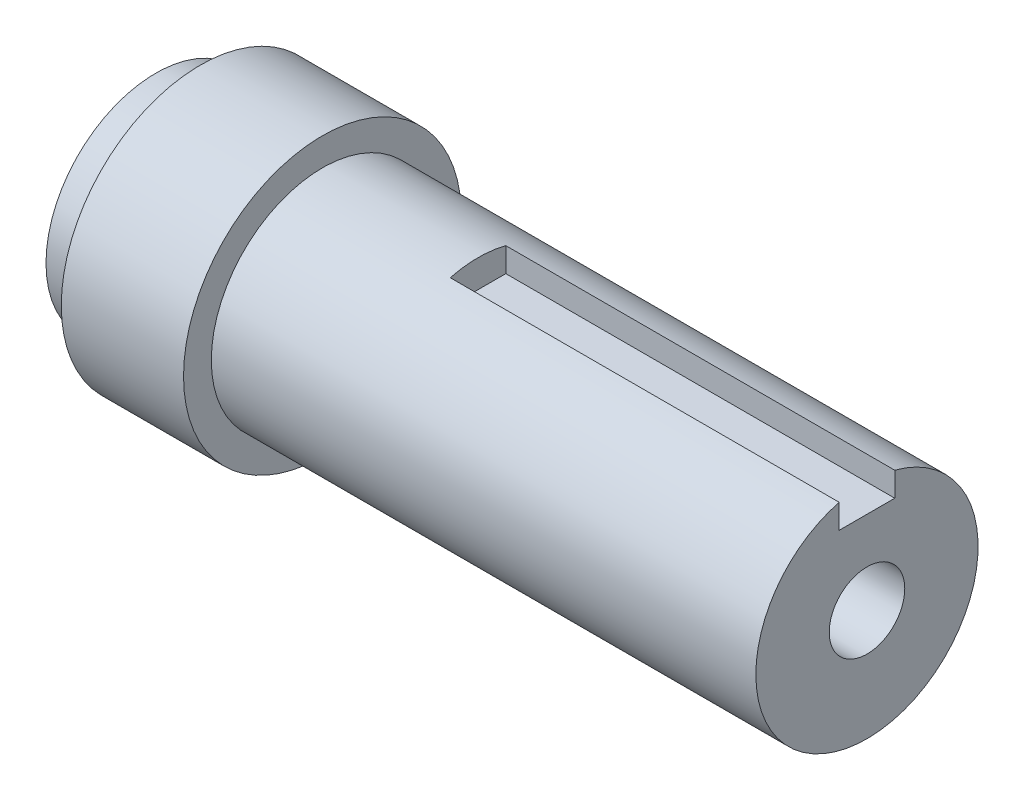
ISO-10303-21;
HEADER;
FILE_DESCRIPTION(('STEP AP214'),'2;1');
FILE_NAME('part.step','',(''),(''),'','','');
FILE_SCHEMA(('AUTOMOTIVE_DESIGN { 1 0 10303 214 1 1 1 1 }'));
ENDSEC;
DATA;
#1=APPLICATION_CONTEXT('core data for automotive mechanical design processes');
#2=APPLICATION_PROTOCOL_DEFINITION('international standard','automotive_design',2000,#1);
#3=PRODUCT_CONTEXT('',#1,'mechanical');
#4=PRODUCT('Part','Part','',(#3));
#5=PRODUCT_RELATED_PRODUCT_CATEGORY('part','',(#4));
#6=PRODUCT_DEFINITION_FORMATION('','',#4);
#7=PRODUCT_DEFINITION_CONTEXT('part definition',#1,'design');
#8=PRODUCT_DEFINITION('design','',#6,#7);
#9=PRODUCT_DEFINITION_SHAPE('','',#8);
#10=(LENGTH_UNIT() NAMED_UNIT(*) SI_UNIT(.MILLI.,.METRE.));
#11=(NAMED_UNIT(*) PLANE_ANGLE_UNIT() SI_UNIT($,.RADIAN.));
#12=(NAMED_UNIT(*) SI_UNIT($,.STERADIAN.) SOLID_ANGLE_UNIT());
#13=UNCERTAINTY_MEASURE_WITH_UNIT(LENGTH_MEASURE(1.E-05),#10,'distance_accuracy_value','');
#14=(GEOMETRIC_REPRESENTATION_CONTEXT(3) GLOBAL_UNCERTAINTY_ASSIGNED_CONTEXT((#13)) GLOBAL_UNIT_ASSIGNED_CONTEXT((#10,
#11,#12)) REPRESENTATION_CONTEXT('',''));
#15=CARTESIAN_POINT('',(0.,0.,0.));
#16=DIRECTION('',(0.,0.,1.));
#17=DIRECTION('',(1.,0.,0.));
#18=AXIS2_PLACEMENT_3D('',#15,#16,#17);
#19=CARTESIAN_POINT('',(0.,0.,0.));
#20=DIRECTION('',(1.,0.,0.));
#21=DIRECTION('',(0.,0.,-1.));
#22=AXIS2_PLACEMENT_3D('',#19,#20,#21);
#23=PLANE('',#22);
#24=CARTESIAN_POINT('',(0.,0.,0.));
#25=DIRECTION('',(-1.,0.,0.));
#26=DIRECTION('',(0.,0.,1.));
#27=AXIS2_PLACEMENT_3D('',#24,#25,#26);
#28=CIRCLE('',#27,9.875);
#29=CARTESIAN_POINT('',(0.,0.,9.875));
#30=VERTEX_POINT('',#29);
#31=EDGE_CURVE('E134',#30,#30,#28,.T.);
#32=ORIENTED_EDGE('',*,*,#31,.T.);
#33=EDGE_LOOP('',(#32));
#34=FACE_BOUND('',#33,.T.);
#35=ADVANCED_FACE('F41',(#34),#23,.F.);
#36=CARTESIAN_POINT('',(-1000.,0.,0.));
#37=DIRECTION('',(-1.,0.,0.));
#38=DIRECTION('',(0.,0.,1.));
#39=AXIS2_PLACEMENT_3D('',#36,#37,#38);
#40=CYLINDRICAL_SURFACE('',#39,9.875);
#41=ORIENTED_EDGE('',*,*,#31,.F.);
#42=EDGE_LOOP('',(#41));
#43=FACE_BOUND('',#42,.T.);
#44=CARTESIAN_POINT('',(4.,0.,0.));
#45=DIRECTION('',(-1.,0.,0.));
#46=DIRECTION('',(0.,0.,1.));
#47=AXIS2_PLACEMENT_3D('',#44,#45,#46);
#48=CIRCLE('',#47,9.875);
#49=CARTESIAN_POINT('',(4.,0.,9.875));
#50=VERTEX_POINT('',#49);
#51=EDGE_CURVE('E131',#50,#50,#48,.T.);
#52=ORIENTED_EDGE('',*,*,#51,.T.);
#53=EDGE_LOOP('',(#52));
#54=FACE_BOUND('',#53,.T.);
#55=ADVANCED_FACE('F159',(#43,#54),#40,.T.);
#56=CARTESIAN_POINT('',(4.00000000000004,0.,-9.875));
#57=DIRECTION('',(1.,0.,0.));
#58=DIRECTION('',(0.,0.,-1.));
#59=AXIS2_PLACEMENT_3D('',#56,#57,#58);
#60=PLANE('',#59);
#61=ORIENTED_EDGE('',*,*,#51,.F.);
#62=EDGE_LOOP('',(#61));
#63=FACE_BOUND('',#62,.T.);
#64=CARTESIAN_POINT('',(4.,0.,0.));
#65=DIRECTION('',(-1.,0.,0.));
#66=DIRECTION('',(0.,0.,1.));
#67=AXIS2_PLACEMENT_3D('',#64,#65,#66);
#68=CIRCLE('',#67,12.5);
#69=CARTESIAN_POINT('',(4.,0.,12.5));
#70=VERTEX_POINT('',#69);
#71=EDGE_CURVE('E128',#70,#70,#68,.T.);
#72=ORIENTED_EDGE('',*,*,#71,.T.);
#73=EDGE_LOOP('',(#72));
#74=FACE_BOUND('',#73,.T.);
#75=ADVANCED_FACE('F164',(#63,#74),#60,.F.);
#76=CARTESIAN_POINT('',(-1000.,0.,0.));
#77=DIRECTION('',(-1.,0.,0.));
#78=DIRECTION('',(0.,0.,1.));
#79=AXIS2_PLACEMENT_3D('',#76,#77,#78);
#80=CYLINDRICAL_SURFACE('',#79,12.5);
#81=ORIENTED_EDGE('',*,*,#71,.F.);
#82=EDGE_LOOP('',(#81));
#83=FACE_BOUND('',#82,.T.);
#84=CARTESIAN_POINT('',(15.0000000000001,0.,0.));
#85=DIRECTION('',(-1.,0.,0.));
#86=DIRECTION('',(0.,0.,1.));
#87=AXIS2_PLACEMENT_3D('',#84,#85,#86);
#88=CIRCLE('',#87,12.5);
#89=CARTESIAN_POINT('',(15.0000000000001,0.,12.5));
#90=VERTEX_POINT('',#89);
#91=EDGE_CURVE('E125',#90,#90,#88,.T.);
#92=ORIENTED_EDGE('',*,*,#91,.T.);
#93=EDGE_LOOP('',(#92));
#94=FACE_BOUND('',#93,.T.);
#95=ADVANCED_FACE('F172',(#83,#94),#80,.T.);
#96=CARTESIAN_POINT('',(15.0000000000001,0.,-12.5));
#97=DIRECTION('',(-1.,0.,0.));
#98=DIRECTION('',(0.,0.,1.));
#99=AXIS2_PLACEMENT_3D('',#96,#97,#98);
#100=PLANE('',#99);
#101=ORIENTED_EDGE('',*,*,#91,.F.);
#102=EDGE_LOOP('',(#101));
#103=FACE_BOUND('',#102,.T.);
#104=CARTESIAN_POINT('',(15.0000000000001,0.,0.));
#105=DIRECTION('',(-1.,0.,0.));
#106=DIRECTION('',(0.,0.,1.));
#107=AXIS2_PLACEMENT_3D('',#104,#105,#106);
#108=CIRCLE('',#107,10.0000000000001);
#109=CARTESIAN_POINT('',(15.0000000000001,0.,10.0000000000001));
#110=VERTEX_POINT('',#109);
#111=EDGE_CURVE('E122',#110,#110,#108,.T.);
#112=ORIENTED_EDGE('',*,*,#111,.T.);
#113=EDGE_LOOP('',(#112));
#114=FACE_BOUND('',#113,.T.);
#115=ADVANCED_FACE('F178',(#103,#114),#100,.F.);
#116=CARTESIAN_POINT('',(-1000.,0.,0.));
#117=DIRECTION('',(-1.,0.,0.));
#118=DIRECTION('',(0.,0.,1.));
#119=AXIS2_PLACEMENT_3D('',#116,#117,#118);
#120=CYLINDRICAL_SURFACE('',#119,10.0000000000001);
#121=ORIENTED_EDGE('',*,*,#111,.F.);
#122=EDGE_LOOP('',(#121));
#123=FACE_BOUND('',#122,.T.);
#124=CARTESIAN_POINT('',(64.0000000000001,0.,0.));
#125=DIRECTION('',(-1.,0.,0.));
#126=DIRECTION('',(0.,0.,1.));
#127=AXIS2_PLACEMENT_3D('',#124,#125,#126);
#128=CIRCLE('',#127,10.0000000000001);
#129=CARTESIAN_POINT('',(64.,9.68245836551866,-2.5));
#130=VERTEX_POINT('',#129);
#131=CARTESIAN_POINT('',(64.,9.68245836551866,2.5));
#132=VERTEX_POINT('',#131);
#133=EDGE_CURVE('E119',#130,#132,#128,.T.);
#134=ORIENTED_EDGE('',*,*,#133,.T.);
#135=DIRECTION('',(-1.,0.,0.));
#136=VECTOR('',#135,1.);
#137=CARTESIAN_POINT('',(-1000.,9.68245836551866,2.5));
#138=LINE('',#137,#136);
#139=CARTESIAN_POINT('',(29.,9.68245836551866,2.5));
#140=VERTEX_POINT('',#139);
#141=EDGE_CURVE('E63',#132,#140,#138,.T.);
#142=ORIENTED_EDGE('',*,*,#141,.T.);
#143=CARTESIAN_POINT('',(28.9999999999999,0.,0.));
#144=DIRECTION('',(-1.,0.,0.));
#145=DIRECTION('',(0.,0.,1.));
#146=AXIS2_PLACEMENT_3D('',#143,#144,#145);
#147=CIRCLE('',#146,10.0000000000001);
#148=CARTESIAN_POINT('',(29.,9.68245836551866,-2.5));
#149=VERTEX_POINT('',#148);
#150=EDGE_CURVE('E11',#140,#149,#147,.T.);
#151=ORIENTED_EDGE('',*,*,#150,.T.);
#152=DIRECTION('',(-1.,0.,0.));
#153=VECTOR('',#152,1.);
#154=CARTESIAN_POINT('',(-1000.,9.68245836551866,-2.5));
#155=LINE('',#154,#153);
#156=EDGE_CURVE('E107',#149,#130,#155,.F.);
#157=ORIENTED_EDGE('',*,*,#156,.T.);
#158=EDGE_LOOP('',(#134,#142,#151,#157));
#159=FACE_BOUND('',#158,.T.);
#160=ADVANCED_FACE('F142',(#123,#159),#120,.T.);
#161=CARTESIAN_POINT('',(64.,0.,-10.0000000000001));
#162=DIRECTION('',(-1.,0.,0.));
#163=DIRECTION('',(0.,0.,1.));
#164=AXIS2_PLACEMENT_3D('',#161,#162,#163);
#165=PLANE('',#164);
#166=CARTESIAN_POINT('',(64.,0.,0.));
#167=DIRECTION('',(1.,0.,0.));
#168=DIRECTION('',(0.,0.,-1.));
#169=AXIS2_PLACEMENT_3D('',#166,#167,#168);
#170=CIRCLE('',#169,3.39999999999999);
#171=CARTESIAN_POINT('',(64.,0.,-3.39999999999999));
#172=VERTEX_POINT('',#171);
#173=EDGE_CURVE('E96',#172,#172,#170,.T.);
#174=ORIENTED_EDGE('',*,*,#173,.F.);
#175=EDGE_LOOP('',(#174));
#176=FACE_BOUND('',#175,.T.);
#177=DIRECTION('',(0.,0.,-1.));
#178=VECTOR('',#177,1.);
#179=CARTESIAN_POINT('',(64.,7.50000000000011,2.5));
#180=LINE('',#179,#178);
#181=CARTESIAN_POINT('',(64.,7.50000000000011,2.5));
#182=VERTEX_POINT('',#181);
#183=CARTESIAN_POINT('',(64.,7.50000000000011,-2.5));
#184=VERTEX_POINT('',#183);
#185=EDGE_CURVE('E55',#182,#184,#180,.T.);
#186=ORIENTED_EDGE('',*,*,#185,.F.);
#187=DIRECTION('',(0.,1.,0.));
#188=VECTOR('',#187,1.);
#189=CARTESIAN_POINT('',(64.,0.,2.5));
#190=LINE('',#189,#188);
#191=EDGE_CURVE('E48',#182,#132,#190,.T.);
#192=ORIENTED_EDGE('',*,*,#191,.T.);
#193=ORIENTED_EDGE('',*,*,#133,.F.);
#194=DIRECTION('',(0.,1.,0.));
#195=VECTOR('',#194,1.);
#196=CARTESIAN_POINT('',(64.,12.5000000000001,-2.5));
#197=LINE('',#196,#195);
#198=EDGE_CURVE('E95',#184,#130,#197,.T.);
#199=ORIENTED_EDGE('',*,*,#198,.F.);
#200=EDGE_LOOP('',(#186,#192,#193,#199));
#201=FACE_BOUND('',#200,.T.);
#202=ADVANCED_FACE('F138',(#176,#201),#165,.F.);
#203=CARTESIAN_POINT('',(29.,10.651664260281,4.33497964081102));
#204=DIRECTION('',(-1.,0.,0.));
#205=DIRECTION('',(0.,-0.376954751374881,0.926231674807066));
#206=AXIS2_PLACEMENT_3D('',#203,#204,#205);
#207=PLANE('',#206);
#208=DIRECTION('',(0.,-1.,0.));
#209=VECTOR('',#208,1.);
#210=CARTESIAN_POINT('',(29.,12.5000000000001,2.5));
#211=LINE('',#210,#209);
#212=CARTESIAN_POINT('',(29.,7.50000000000011,2.5));
#213=VERTEX_POINT('',#212);
#214=EDGE_CURVE('E102',#140,#213,#211,.T.);
#215=ORIENTED_EDGE('',*,*,#214,.T.);
#216=DIRECTION('',(0.,0.,-1.));
#217=VECTOR('',#216,1.);
#218=CARTESIAN_POINT('',(29.,7.50000000000011,2.5));
#219=LINE('',#218,#217);
#220=CARTESIAN_POINT('',(29.,7.50000000000011,-2.5));
#221=VERTEX_POINT('',#220);
#222=EDGE_CURVE('E109',#213,#221,#219,.T.);
#223=ORIENTED_EDGE('',*,*,#222,.T.);
#224=DIRECTION('',(0.,1.,0.));
#225=VECTOR('',#224,1.);
#226=CARTESIAN_POINT('',(29.,12.5000000000001,-2.5));
#227=LINE('',#226,#225);
#228=EDGE_CURVE('E104',#221,#149,#227,.T.);
#229=ORIENTED_EDGE('',*,*,#228,.T.);
#230=ORIENTED_EDGE('',*,*,#150,.F.);
#231=EDGE_LOOP('',(#215,#223,#229,#230));
#232=FACE_BOUND('',#231,.T.);
#233=ADVANCED_FACE('F146',(#232),#207,.F.);
#234=CARTESIAN_POINT('',(21.9289321881345,12.5000000000001,2.5));
#235=DIRECTION('',(0.,0.,1.));
#236=DIRECTION('',(0.,-1.,0.));
#237=AXIS2_PLACEMENT_3D('',#234,#235,#236);
#238=PLANE('',#237);
#239=ORIENTED_EDGE('',*,*,#191,.F.);
#240=DIRECTION('',(1.,0.,0.));
#241=VECTOR('',#240,1.);
#242=CARTESIAN_POINT('',(21.9289321881345,7.50000000000011,2.5));
#243=LINE('',#242,#241);
#244=EDGE_CURVE('E112',#213,#182,#243,.T.);
#245=ORIENTED_EDGE('',*,*,#244,.F.);
#246=ORIENTED_EDGE('',*,*,#214,.F.);
#247=ORIENTED_EDGE('',*,*,#141,.F.);
#248=EDGE_LOOP('',(#239,#245,#246,#247));
#249=FACE_BOUND('',#248,.T.);
#250=ADVANCED_FACE('F148',(#249),#238,.F.);
#251=CARTESIAN_POINT('',(21.9289321881345,12.5000000000001,-2.5));
#252=DIRECTION('',(0.,0.,-1.));
#253=DIRECTION('',(-1.,0.,0.));
#254=AXIS2_PLACEMENT_3D('',#251,#252,#253);
#255=PLANE('',#254);
#256=ORIENTED_EDGE('',*,*,#228,.F.);
#257=DIRECTION('',(1.,0.,0.));
#258=VECTOR('',#257,1.);
#259=CARTESIAN_POINT('',(21.9289321881345,7.50000000000011,-2.5));
#260=LINE('',#259,#258);
#261=EDGE_CURVE('E108',#221,#184,#260,.T.);
#262=ORIENTED_EDGE('',*,*,#261,.T.);
#263=ORIENTED_EDGE('',*,*,#198,.T.);
#264=ORIENTED_EDGE('',*,*,#156,.F.);
#265=EDGE_LOOP('',(#256,#262,#263,#264));
#266=FACE_BOUND('',#265,.T.);
#267=ADVANCED_FACE('F144',(#266),#255,.F.);
#268=CARTESIAN_POINT('',(21.9289321881345,7.50000000000011,2.5));
#269=DIRECTION('',(0.,-1.,0.));
#270=DIRECTION('',(0.,0.,-1.));
#271=AXIS2_PLACEMENT_3D('',#268,#269,#270);
#272=PLANE('',#271);
#273=ORIENTED_EDGE('',*,*,#244,.T.);
#274=ORIENTED_EDGE('',*,*,#185,.T.);
#275=ORIENTED_EDGE('',*,*,#261,.F.);
#276=ORIENTED_EDGE('',*,*,#222,.F.);
#277=EDGE_LOOP('',(#273,#274,#275,#276));
#278=FACE_BOUND('',#277,.T.);
#279=ADVANCED_FACE('F89',(#278),#272,.F.);
#280=CARTESIAN_POINT('',(39.,0.,0.));
#281=DIRECTION('',(1.,0.,0.));
#282=DIRECTION('',(0.,0.,-1.));
#283=AXIS2_PLACEMENT_3D('',#280,#281,#282);
#284=CONICAL_SURFACE('',#283,3.39999999999999,1.02974425867665);
#285=CARTESIAN_POINT('',(36.9570738953063,0.,0.));
#286=VERTEX_POINT('',#285);
#287=VERTEX_LOOP('',#286);
#288=FACE_BOUND('',#287,.T.);
#289=CARTESIAN_POINT('',(39.,0.,0.));
#290=DIRECTION('',(1.,0.,0.));
#291=DIRECTION('',(0.,0.,-1.));
#292=AXIS2_PLACEMENT_3D('',#289,#290,#291);
#293=CIRCLE('',#292,3.39999999999999);
#294=CARTESIAN_POINT('',(39.,0.,-3.39999999999999));
#295=VERTEX_POINT('',#294);
#296=EDGE_CURVE('E93',#295,#295,#293,.T.);
#297=ORIENTED_EDGE('',*,*,#296,.T.);
#298=EDGE_LOOP('',(#297));
#299=FACE_BOUND('',#298,.T.);
#300=ADVANCED_FACE('F85',(#288,#299),#284,.F.);
#301=CARTESIAN_POINT('',(64.,0.,0.));
#302=DIRECTION('',(1.,0.,0.));
#303=DIRECTION('',(0.,0.,-1.));
#304=AXIS2_PLACEMENT_3D('',#301,#302,#303);
#305=CYLINDRICAL_SURFACE('',#304,3.39999999999999);
#306=ORIENTED_EDGE('',*,*,#296,.F.);
#307=EDGE_LOOP('',(#306));
#308=FACE_BOUND('',#307,.T.);
#309=ORIENTED_EDGE('',*,*,#173,.T.);
#310=EDGE_LOOP('',(#309));
#311=FACE_BOUND('',#310,.T.);
#312=ADVANCED_FACE('F88',(#308,#311),#305,.F.);
#313=CLOSED_SHELL('',(#35,#55,#75,#95,#115,#160,#202,#233,#250,#267,#279,#300,#312));
#314=MANIFOLD_SOLID_BREP('B2',#313);
#315=ADVANCED_BREP_SHAPE_REPRESENTATION('',(#18,#314),#14);
#316=SHAPE_DEFINITION_REPRESENTATION(#9,#315);
ENDSEC;
END-ISO-10303-21;
